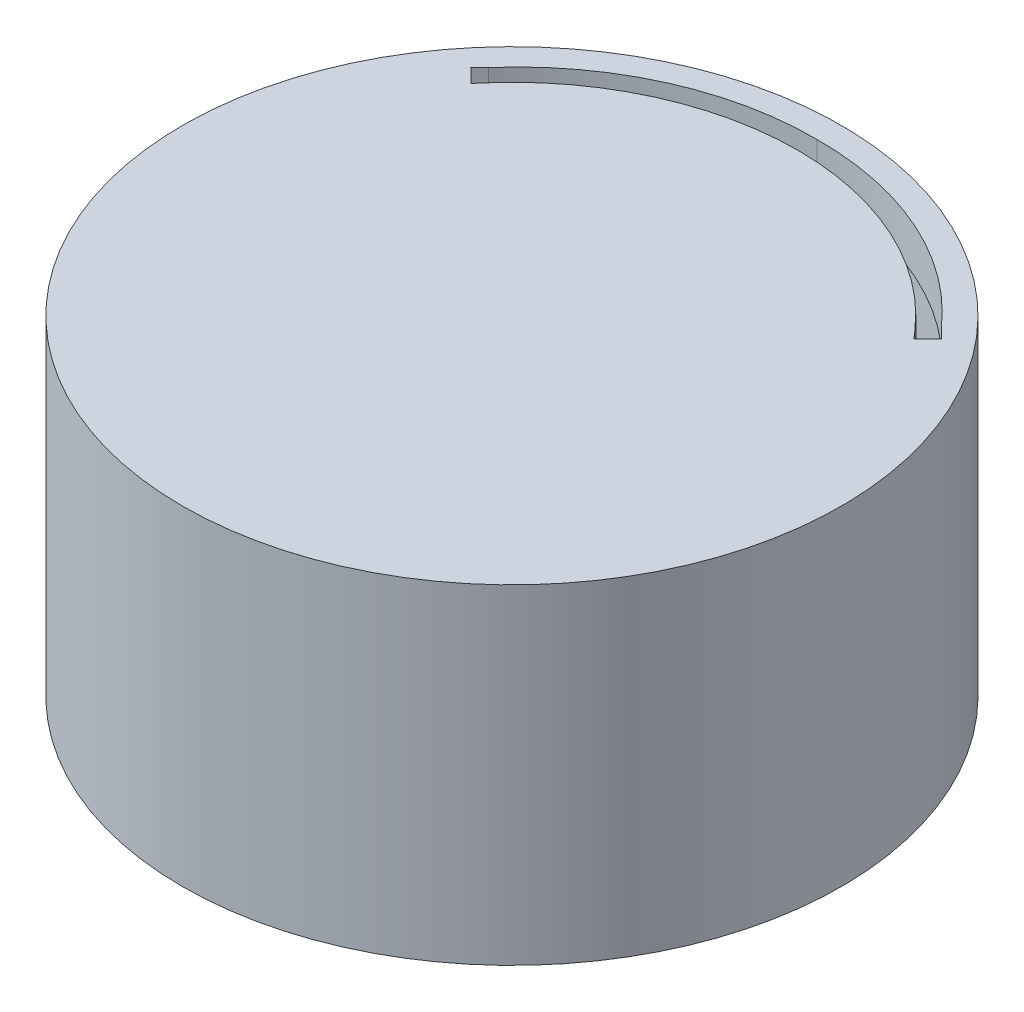
ISO-10303-21;
HEADER;
FILE_DESCRIPTION(('STEP AP214'),'2;1');
FILE_NAME('part.step','',(''),(''),'','','');
FILE_SCHEMA(('AUTOMOTIVE_DESIGN { 1 0 10303 214 1 1 1 1 }'));
ENDSEC;
DATA;
#1=APPLICATION_CONTEXT('core data for automotive mechanical design processes');
#2=APPLICATION_PROTOCOL_DEFINITION('international standard','automotive_design',2000,#1);
#3=PRODUCT_CONTEXT('',#1,'mechanical');
#4=PRODUCT('Part','Part','',(#3));
#5=PRODUCT_RELATED_PRODUCT_CATEGORY('part','',(#4));
#6=PRODUCT_DEFINITION_FORMATION('','',#4);
#7=PRODUCT_DEFINITION_CONTEXT('part definition',#1,'design');
#8=PRODUCT_DEFINITION('design','',#6,#7);
#9=PRODUCT_DEFINITION_SHAPE('','',#8);
#10=(LENGTH_UNIT() NAMED_UNIT(*) SI_UNIT(.MILLI.,.METRE.));
#11=(NAMED_UNIT(*) PLANE_ANGLE_UNIT() SI_UNIT($,.RADIAN.));
#12=(NAMED_UNIT(*) SI_UNIT($,.STERADIAN.) SOLID_ANGLE_UNIT());
#13=UNCERTAINTY_MEASURE_WITH_UNIT(LENGTH_MEASURE(1.E-05),#10,'distance_accuracy_value','');
#14=(GEOMETRIC_REPRESENTATION_CONTEXT(3) GLOBAL_UNCERTAINTY_ASSIGNED_CONTEXT((#13)) GLOBAL_UNIT_ASSIGNED_CONTEXT((#10,
#11,#12)) REPRESENTATION_CONTEXT('',''));
#15=CARTESIAN_POINT('',(0.,0.,0.));
#16=DIRECTION('',(0.,0.,1.));
#17=DIRECTION('',(1.,0.,0.));
#18=AXIS2_PLACEMENT_3D('',#15,#16,#17);
#19=CARTESIAN_POINT('',(0.,30.,0.));
#20=DIRECTION('',(0.,1.,0.));
#21=DIRECTION('',(0.,0.,1.));
#22=AXIS2_PLACEMENT_3D('',#19,#20,#21);
#23=PLANE('',#22);
#24=CARTESIAN_POINT('',(0.,30.,0.));
#25=DIRECTION('',(0.,1.,0.));
#26=DIRECTION('',(0.,0.,1.));
#27=AXIS2_PLACEMENT_3D('',#24,#25,#26);
#28=CIRCLE('',#27,30.);
#29=CARTESIAN_POINT('',(0.,30.,30.));
#30=VERTEX_POINT('',#29);
#31=EDGE_CURVE('E140',#30,#30,#28,.T.);
#32=ORIENTED_EDGE('',*,*,#31,.T.);
#33=EDGE_LOOP('',(#32));
#34=FACE_BOUND('',#33,.T.);
#35=CARTESIAN_POINT('',(-0.269476232128927,30.,-0.813193995065218));
#36=DIRECTION('',(0.,1.,0.));
#37=DIRECTION('',(0.,0.,1.));
#38=AXIS2_PLACEMENT_3D('',#35,#36,#37);
#39=CIRCLE('',#38,26.9706805768212);
#40=CARTESIAN_POINT('',(-0.0254023069730041,30.,-27.7827701633327));
#41=VERTEX_POINT('',#40);
#42=CARTESIAN_POINT('',(-20.6220749338951,30.,-18.5103501751351));
#43=VERTEX_POINT('',#42);
#44=EDGE_CURVE('E121',#41,#43,#39,.T.);
#45=ORIENTED_EDGE('',*,*,#44,.F.);
#46=CARTESIAN_POINT('',(0.218671618182906,30.,-0.813193995065218));
#47=DIRECTION('',(0.,1.,0.));
#48=DIRECTION('',(0.,0.,1.));
#49=AXIS2_PLACEMENT_3D('',#46,#47,#48);
#50=CIRCLE('',#49,26.9706805768212);
#51=CARTESIAN_POINT('',(20.5712703199491,30.,-18.5103501751351));
#52=VERTEX_POINT('',#51);
#53=EDGE_CURVE('E110',#41,#52,#50,.F.);
#54=ORIENTED_EDGE('',*,*,#53,.T.);
#55=DIRECTION('',(-0.707106781186542,0.,-0.707106781186554));
#56=VECTOR('',#55,1.);
#57=CARTESIAN_POINT('',(19.5408102475423,30.,-19.540810247542));
#58=LINE('',#57,#56);
#59=CARTESIAN_POINT('',(21.3902384528601,30.,-17.6913820422241));
#60=VERTEX_POINT('',#59);
#61=EDGE_CURVE('E115',#60,#52,#58,.T.);
#62=ORIENTED_EDGE('',*,*,#61,.F.);
#63=DIRECTION('',(-0.715524800333269,0.,0.698587331768932));
#64=VECTOR('',#63,1.);
#65=CARTESIAN_POINT('',(1.59580190612503,30.,1.63449262293414));
#66=LINE('',#65,#64);
#67=CARTESIAN_POINT('',(20.1244711318793,30.,-16.4555771966164));
#68=VERTEX_POINT('',#67);
#69=EDGE_CURVE('E185',#60,#68,#66,.T.);
#70=ORIENTED_EDGE('',*,*,#69,.T.);
#71=DIRECTION('',(-0.654896156385466,0.,-0.755718879181633));
#72=VECTOR('',#71,1.);
#73=CARTESIAN_POINT('',(19.6374586279711,30.,-17.0175663608715));
#74=LINE('',#73,#72);
#75=CARTESIAN_POINT('',(19.5005232357283,30.,-17.1755832619283));
#76=VERTEX_POINT('',#75);
#77=EDGE_CURVE('E188',#68,#76,#74,.T.);
#78=ORIENTED_EDGE('',*,*,#77,.T.);
#79=CARTESIAN_POINT('',(-0.0653695292751055,30.,-0.0864662667465453));
#80=DIRECTION('',(0.,1.,0.));
#81=DIRECTION('',(0.,0.,1.));
#82=AXIS2_PLACEMENT_3D('',#79,#80,#81);
#83=CIRCLE('',#82,25.978107694107);
#84=CARTESIAN_POINT('',(-0.0254023069730072,30.,-26.0645432161238));
#85=VERTEX_POINT('',#84);
#86=EDGE_CURVE('E191',#85,#76,#83,.F.);
#87=ORIENTED_EDGE('',*,*,#86,.F.);
#88=CARTESIAN_POINT('',(0.014564915329085,30.,-0.0864662667465453));
#89=DIRECTION('',(0.,1.,0.));
#90=DIRECTION('',(0.,0.,1.));
#91=AXIS2_PLACEMENT_3D('',#88,#89,#90);
#92=CIRCLE('',#91,25.978107694107);
#93=CARTESIAN_POINT('',(-19.5513278496743,30.,-17.1755832619283));
#94=VERTEX_POINT('',#93);
#95=EDGE_CURVE('E193',#85,#94,#92,.T.);
#96=ORIENTED_EDGE('',*,*,#95,.T.);
#97=DIRECTION('',(0.654896156385466,0.,-0.755718879181633));
#98=VECTOR('',#97,1.);
#99=CARTESIAN_POINT('',(-19.6664737030836,30.,-17.0427104477693));
#100=LINE('',#99,#98);
#101=CARTESIAN_POINT('',(-20.1752757458253,30.,-16.4555771966164));
#102=VERTEX_POINT('',#101);
#103=EDGE_CURVE('E196',#102,#94,#100,.T.);
#104=ORIENTED_EDGE('',*,*,#103,.F.);
#105=DIRECTION('',(0.715524800333269,0.,0.698587331768932));
#106=VECTOR('',#105,1.);
#107=CARTESIAN_POINT('',(-1.62059579025611,30.,1.65988764254816));
#108=LINE('',#107,#106);
#109=CARTESIAN_POINT('',(-21.4410430668062,30.,-17.6913820422241));
#110=VERTEX_POINT('',#109);
#111=EDGE_CURVE('E133',#110,#102,#108,.T.);
#112=ORIENTED_EDGE('',*,*,#111,.F.);
#113=DIRECTION('',(0.707106781186542,0.,-0.707106781186554));
#114=VECTOR('',#113,1.);
#115=CARTESIAN_POINT('',(-19.5662125545153,30.,-19.566212554515));
#116=LINE('',#115,#114);
#117=EDGE_CURVE('E127',#110,#43,#116,.T.);
#118=ORIENTED_EDGE('',*,*,#117,.T.);
#119=EDGE_LOOP('',(#45,#54,#62,#70,#78,#87,#96,#104,#112,#118));
#120=FACE_BOUND('',#119,.T.);
#121=ADVANCED_FACE('F36',(#34,#120),#23,.T.);
#122=CARTESIAN_POINT('',(0.,26.,0.));
#123=DIRECTION('',(0.,1.,0.));
#124=DIRECTION('',(0.,0.,1.));
#125=AXIS2_PLACEMENT_3D('',#122,#123,#124);
#126=PLANE('',#125);
#127=CARTESIAN_POINT('',(0.,26.,0.));
#128=DIRECTION('',(0.,1.,0.));
#129=DIRECTION('',(0.,0.,1.));
#130=AXIS2_PLACEMENT_3D('',#127,#128,#129);
#131=CIRCLE('',#130,29.);
#132=CARTESIAN_POINT('',(0.,26.,29.));
#133=VERTEX_POINT('',#132);
#134=EDGE_CURVE('E131',#133,#133,#131,.T.);
#135=ORIENTED_EDGE('',*,*,#134,.F.);
#136=EDGE_LOOP('',(#135));
#137=FACE_BOUND('',#136,.T.);
#138=CARTESIAN_POINT('',(0.218671618182906,26.,-0.813193995065218));
#139=DIRECTION('',(0.,1.,0.));
#140=DIRECTION('',(0.,0.,1.));
#141=AXIS2_PLACEMENT_3D('',#138,#139,#140);
#142=CIRCLE('',#141,26.9706805768212);
#143=CARTESIAN_POINT('',(-0.0254023069730041,26.,-27.7827701633327));
#144=VERTEX_POINT('',#143);
#145=CARTESIAN_POINT('',(20.5712703199491,26.,-18.5103501751351));
#146=VERTEX_POINT('',#145);
#147=EDGE_CURVE('E143',#144,#146,#142,.F.);
#148=ORIENTED_EDGE('',*,*,#147,.F.);
#149=CARTESIAN_POINT('',(-0.269476232128927,26.,-0.813193995065218));
#150=DIRECTION('',(0.,1.,0.));
#151=DIRECTION('',(0.,0.,1.));
#152=AXIS2_PLACEMENT_3D('',#149,#150,#151);
#153=CIRCLE('',#152,26.9706805768212);
#154=CARTESIAN_POINT('',(-20.6220749338951,26.,-18.5103501751351));
#155=VERTEX_POINT('',#154);
#156=EDGE_CURVE('E11',#144,#155,#153,.T.);
#157=ORIENTED_EDGE('',*,*,#156,.T.);
#158=DIRECTION('',(0.707106781186542,0.,-0.707106781186554));
#159=VECTOR('',#158,1.);
#160=CARTESIAN_POINT('',(-19.5662125545153,26.,-19.566212554515));
#161=LINE('',#160,#159);
#162=CARTESIAN_POINT('',(-21.4410430668062,26.,-17.6913820422241));
#163=VERTEX_POINT('',#162);
#164=EDGE_CURVE('E44',#163,#155,#161,.T.);
#165=ORIENTED_EDGE('',*,*,#164,.F.);
#166=DIRECTION('',(0.715524800333269,0.,0.698587331768932));
#167=VECTOR('',#166,1.);
#168=CARTESIAN_POINT('',(-1.62059579025611,26.,1.65988764254816));
#169=LINE('',#168,#167);
#170=CARTESIAN_POINT('',(-20.1752757458253,26.,-16.4555771966164));
#171=VERTEX_POINT('',#170);
#172=EDGE_CURVE('E162',#163,#171,#169,.T.);
#173=ORIENTED_EDGE('',*,*,#172,.T.);
#174=DIRECTION('',(0.654896156385466,0.,-0.755718879181633));
#175=VECTOR('',#174,1.);
#176=CARTESIAN_POINT('',(-19.6664737030836,26.,-17.0427104477693));
#177=LINE('',#176,#175);
#178=CARTESIAN_POINT('',(-19.5513278496743,26.,-17.1755832619283));
#179=VERTEX_POINT('',#178);
#180=EDGE_CURVE('E159',#171,#179,#177,.T.);
#181=ORIENTED_EDGE('',*,*,#180,.T.);
#182=CARTESIAN_POINT('',(0.014564915329085,26.,-0.0864662667465453));
#183=DIRECTION('',(0.,1.,0.));
#184=DIRECTION('',(0.,0.,1.));
#185=AXIS2_PLACEMENT_3D('',#182,#183,#184);
#186=CIRCLE('',#185,25.978107694107);
#187=CARTESIAN_POINT('',(-0.0254023069730072,26.,-26.0645432161238));
#188=VERTEX_POINT('',#187);
#189=EDGE_CURVE('E157',#188,#179,#186,.T.);
#190=ORIENTED_EDGE('',*,*,#189,.F.);
#191=CARTESIAN_POINT('',(-0.0653695292751055,26.,-0.0864662667465453));
#192=DIRECTION('',(0.,1.,0.));
#193=DIRECTION('',(0.,0.,1.));
#194=AXIS2_PLACEMENT_3D('',#191,#192,#193);
#195=CIRCLE('',#194,25.978107694107);
#196=CARTESIAN_POINT('',(19.5005232357283,26.,-17.1755832619283));
#197=VERTEX_POINT('',#196);
#198=EDGE_CURVE('E154',#188,#197,#195,.F.);
#199=ORIENTED_EDGE('',*,*,#198,.T.);
#200=DIRECTION('',(-0.654896156385466,0.,-0.755718879181633));
#201=VECTOR('',#200,1.);
#202=CARTESIAN_POINT('',(19.6374586279711,26.,-17.0175663608715));
#203=LINE('',#202,#201);
#204=CARTESIAN_POINT('',(20.1244711318793,26.,-16.4555771966164));
#205=VERTEX_POINT('',#204);
#206=EDGE_CURVE('E152',#205,#197,#203,.T.);
#207=ORIENTED_EDGE('',*,*,#206,.F.);
#208=DIRECTION('',(-0.715524800333269,0.,0.698587331768932));
#209=VECTOR('',#208,1.);
#210=CARTESIAN_POINT('',(1.59580190612503,26.,1.63449262293414));
#211=LINE('',#210,#209);
#212=CARTESIAN_POINT('',(21.3902384528601,26.,-17.6913820422241));
#213=VERTEX_POINT('',#212);
#214=EDGE_CURVE('E150',#213,#205,#211,.T.);
#215=ORIENTED_EDGE('',*,*,#214,.F.);
#216=DIRECTION('',(-0.707106781186542,0.,-0.707106781186554));
#217=VECTOR('',#216,1.);
#218=CARTESIAN_POINT('',(19.5408102475423,26.,-19.540810247542));
#219=LINE('',#218,#217);
#220=EDGE_CURVE('E147',#213,#146,#219,.T.);
#221=ORIENTED_EDGE('',*,*,#220,.T.);
#222=EDGE_LOOP('',(#148,#157,#165,#173,#181,#190,#199,#207,#215,#221));
#223=FACE_BOUND('',#222,.T.);
#224=ADVANCED_FACE('F172',(#137,#223),#126,.F.);
#225=CARTESIAN_POINT('',(0.,30.,0.));
#226=DIRECTION('',(0.,-1.,0.));
#227=DIRECTION('',(0.,0.,-1.));
#228=AXIS2_PLACEMENT_3D('',#225,#226,#227);
#229=CYLINDRICAL_SURFACE('',#228,30.);
#230=ORIENTED_EDGE('',*,*,#31,.F.);
#231=EDGE_LOOP('',(#230));
#232=FACE_BOUND('',#231,.T.);
#233=CARTESIAN_POINT('',(0.,0.,0.));
#234=DIRECTION('',(0.,1.,0.));
#235=DIRECTION('',(0.,0.,1.));
#236=AXIS2_PLACEMENT_3D('',#233,#234,#235);
#237=CIRCLE('',#236,30.);
#238=CARTESIAN_POINT('',(0.,0.,30.));
#239=VERTEX_POINT('',#238);
#240=EDGE_CURVE('E138',#239,#239,#237,.T.);
#241=ORIENTED_EDGE('',*,*,#240,.T.);
#242=EDGE_LOOP('',(#241));
#243=FACE_BOUND('',#242,.T.);
#244=ADVANCED_FACE('F38',(#232,#243),#229,.T.);
#245=CARTESIAN_POINT('',(0.,0.,0.));
#246=DIRECTION('',(0.,1.,0.));
#247=DIRECTION('',(0.,0.,1.));
#248=AXIS2_PLACEMENT_3D('',#245,#246,#247);
#249=PLANE('',#248);
#250=CARTESIAN_POINT('',(0.,0.,0.));
#251=DIRECTION('',(0.,1.,0.));
#252=DIRECTION('',(0.,0.,1.));
#253=AXIS2_PLACEMENT_3D('',#250,#251,#252);
#254=CIRCLE('',#253,29.);
#255=CARTESIAN_POINT('',(0.,0.,29.));
#256=VERTEX_POINT('',#255);
#257=EDGE_CURVE('E128',#256,#256,#254,.T.);
#258=ORIENTED_EDGE('',*,*,#257,.T.);
#259=EDGE_LOOP('',(#258));
#260=FACE_BOUND('',#259,.T.);
#261=ORIENTED_EDGE('',*,*,#240,.F.);
#262=EDGE_LOOP('',(#261));
#263=FACE_BOUND('',#262,.T.);
#264=ADVANCED_FACE('F249',(#260,#263),#249,.F.);
#265=CARTESIAN_POINT('',(0.,26.,0.));
#266=DIRECTION('',(0.,-1.,0.));
#267=DIRECTION('',(0.,0.,-1.));
#268=AXIS2_PLACEMENT_3D('',#265,#266,#267);
#269=CYLINDRICAL_SURFACE('',#268,29.);
#270=ORIENTED_EDGE('',*,*,#134,.T.);
#271=EDGE_LOOP('',(#270));
#272=FACE_BOUND('',#271,.T.);
#273=ORIENTED_EDGE('',*,*,#257,.F.);
#274=EDGE_LOOP('',(#273));
#275=FACE_BOUND('',#274,.T.);
#276=ADVANCED_FACE('F248',(#272,#275),#269,.F.);
#277=CARTESIAN_POINT('',(-0.269476232128927,74.,-0.813193995065218));
#278=DIRECTION('',(0.,-1.,0.));
#279=DIRECTION('',(0.,0.,-1.));
#280=AXIS2_PLACEMENT_3D('',#277,#278,#279);
#281=CYLINDRICAL_SURFACE('',#280,26.9706805768212);
#282=ORIENTED_EDGE('',*,*,#44,.T.);
#283=DIRECTION('',(0.,-1.,0.));
#284=VECTOR('',#283,1.);
#285=CARTESIAN_POINT('',(-20.6220749338951,74.,-18.5103501751351));
#286=LINE('',#285,#284);
#287=EDGE_CURVE('E116',#43,#155,#286,.T.);
#288=ORIENTED_EDGE('',*,*,#287,.T.);
#289=ORIENTED_EDGE('',*,*,#156,.F.);
#290=DIRECTION('',(0.,-1.,0.));
#291=VECTOR('',#290,1.);
#292=CARTESIAN_POINT('',(-0.0254023069730041,74.,-27.7827701633327));
#293=LINE('',#292,#291);
#294=EDGE_CURVE('E56',#41,#144,#293,.T.);
#295=ORIENTED_EDGE('',*,*,#294,.F.);
#296=EDGE_LOOP('',(#282,#288,#289,#295));
#297=FACE_BOUND('',#296,.T.);
#298=ADVANCED_FACE('F119',(#297),#281,.F.);
#299=CARTESIAN_POINT('',(-20.6220749338951,74.,-18.5103501751351));
#300=DIRECTION('',(0.707106781186554,0.,0.707106781186542));
#301=DIRECTION('',(0.707106781186542,0.,-0.707106781186554));
#302=AXIS2_PLACEMENT_3D('',#299,#300,#301);
#303=PLANE('',#302);
#304=DIRECTION('',(0.,-1.,0.));
#305=VECTOR('',#304,1.);
#306=CARTESIAN_POINT('',(-21.4410430668062,74.,-17.6913820422241));
#307=LINE('',#306,#305);
#308=EDGE_CURVE('E169',#110,#163,#307,.T.);
#309=ORIENTED_EDGE('',*,*,#308,.T.);
#310=ORIENTED_EDGE('',*,*,#164,.T.);
#311=ORIENTED_EDGE('',*,*,#287,.F.);
#312=ORIENTED_EDGE('',*,*,#117,.F.);
#313=EDGE_LOOP('',(#309,#310,#311,#312));
#314=FACE_BOUND('',#313,.T.);
#315=ADVANCED_FACE('F167',(#314),#303,.T.);
#316=CARTESIAN_POINT('',(-20.1752757458253,74.,-16.4555771966164));
#317=DIRECTION('',(-0.698587331768932,0.,0.715524800333269));
#318=DIRECTION('',(0.715524800333269,0.,0.698587331768932));
#319=AXIS2_PLACEMENT_3D('',#316,#317,#318);
#320=PLANE('',#319);
#321=ORIENTED_EDGE('',*,*,#111,.T.);
#322=DIRECTION('',(0.,-1.,0.));
#323=VECTOR('',#322,1.);
#324=CARTESIAN_POINT('',(-20.1752757458253,74.,-16.4555771966164));
#325=LINE('',#324,#323);
#326=EDGE_CURVE('E201',#102,#171,#325,.T.);
#327=ORIENTED_EDGE('',*,*,#326,.T.);
#328=ORIENTED_EDGE('',*,*,#172,.F.);
#329=ORIENTED_EDGE('',*,*,#308,.F.);
#330=EDGE_LOOP('',(#321,#327,#328,#329));
#331=FACE_BOUND('',#330,.T.);
#332=ADVANCED_FACE('F200',(#331),#320,.F.);
#333=CARTESIAN_POINT('',(-19.5513278496743,74.,-17.1755832619283));
#334=DIRECTION('',(0.755718879181633,0.,0.654896156385466));
#335=DIRECTION('',(0.654896156385466,0.,-0.755718879181633));
#336=AXIS2_PLACEMENT_3D('',#333,#334,#335);
#337=PLANE('',#336);
#338=ORIENTED_EDGE('',*,*,#103,.T.);
#339=DIRECTION('',(0.,-1.,0.));
#340=VECTOR('',#339,1.);
#341=CARTESIAN_POINT('',(-19.5513278496743,74.,-17.1755832619283));
#342=LINE('',#341,#340);
#343=EDGE_CURVE('E207',#94,#179,#342,.T.);
#344=ORIENTED_EDGE('',*,*,#343,.T.);
#345=ORIENTED_EDGE('',*,*,#180,.F.);
#346=ORIENTED_EDGE('',*,*,#326,.F.);
#347=EDGE_LOOP('',(#338,#344,#345,#346));
#348=FACE_BOUND('',#347,.T.);
#349=ADVANCED_FACE('F204',(#348),#337,.F.);
#350=CARTESIAN_POINT('',(0.014564915329085,74.,-0.0864662667465453));
#351=DIRECTION('',(0.,-1.,0.));
#352=DIRECTION('',(0.,0.,-1.));
#353=AXIS2_PLACEMENT_3D('',#350,#351,#352);
#354=CYLINDRICAL_SURFACE('',#353,25.978107694107);
#355=DIRECTION('',(0.,-1.,0.));
#356=VECTOR('',#355,1.);
#357=CARTESIAN_POINT('',(-0.0254023069730072,74.,-26.0645432161238));
#358=LINE('',#357,#356);
#359=EDGE_CURVE('E214',#85,#188,#358,.T.);
#360=ORIENTED_EDGE('',*,*,#359,.T.);
#361=ORIENTED_EDGE('',*,*,#189,.T.);
#362=ORIENTED_EDGE('',*,*,#343,.F.);
#363=ORIENTED_EDGE('',*,*,#95,.F.);
#364=EDGE_LOOP('',(#360,#361,#362,#363));
#365=FACE_BOUND('',#364,.T.);
#366=ADVANCED_FACE('F213',(#365),#354,.T.);
#367=CARTESIAN_POINT('',(-0.0653695292751055,74.,-0.0864662667465453));
#368=DIRECTION('',(0.,-1.,0.));
#369=DIRECTION('',(0.,0.,-1.));
#370=AXIS2_PLACEMENT_3D('',#367,#368,#369);
#371=CYLINDRICAL_SURFACE('',#370,25.978107694107);
#372=ORIENTED_EDGE('',*,*,#86,.T.);
#373=DIRECTION('',(0.,-1.,0.));
#374=VECTOR('',#373,1.);
#375=CARTESIAN_POINT('',(19.5005232357283,74.,-17.1755832619283));
#376=LINE('',#375,#374);
#377=EDGE_CURVE('E220',#76,#197,#376,.T.);
#378=ORIENTED_EDGE('',*,*,#377,.T.);
#379=ORIENTED_EDGE('',*,*,#198,.F.);
#380=ORIENTED_EDGE('',*,*,#359,.F.);
#381=EDGE_LOOP('',(#372,#378,#379,#380));
#382=FACE_BOUND('',#381,.T.);
#383=ADVANCED_FACE('F217',(#382),#371,.T.);
#384=CARTESIAN_POINT('',(19.5005232357283,74.,-17.1755832619283));
#385=DIRECTION('',(0.755718879181633,0.,-0.654896156385466));
#386=DIRECTION('',(-0.654896156385466,0.,-0.755718879181633));
#387=AXIS2_PLACEMENT_3D('',#384,#385,#386);
#388=PLANE('',#387);
#389=DIRECTION('',(0.,-1.,0.));
#390=VECTOR('',#389,1.);
#391=CARTESIAN_POINT('',(20.1244711318793,74.,-16.4555771966164));
#392=LINE('',#391,#390);
#393=EDGE_CURVE('E180',#68,#205,#392,.T.);
#394=ORIENTED_EDGE('',*,*,#393,.T.);
#395=ORIENTED_EDGE('',*,*,#206,.T.);
#396=ORIENTED_EDGE('',*,*,#377,.F.);
#397=ORIENTED_EDGE('',*,*,#77,.F.);
#398=EDGE_LOOP('',(#394,#395,#396,#397));
#399=FACE_BOUND('',#398,.T.);
#400=ADVANCED_FACE('F228',(#399),#388,.T.);
#401=CARTESIAN_POINT('',(20.1244711318793,74.,-16.4555771966164));
#402=DIRECTION('',(-0.698587331768932,0.,-0.715524800333269));
#403=DIRECTION('',(-0.715524800333269,0.,0.698587331768932));
#404=AXIS2_PLACEMENT_3D('',#401,#402,#403);
#405=PLANE('',#404);
#406=DIRECTION('',(0.,-1.,0.));
#407=VECTOR('',#406,1.);
#408=CARTESIAN_POINT('',(21.3902384528601,74.,-17.6913820422241));
#409=LINE('',#408,#407);
#410=EDGE_CURVE('E178',#60,#213,#409,.T.);
#411=ORIENTED_EDGE('',*,*,#410,.T.);
#412=ORIENTED_EDGE('',*,*,#214,.T.);
#413=ORIENTED_EDGE('',*,*,#393,.F.);
#414=ORIENTED_EDGE('',*,*,#69,.F.);
#415=EDGE_LOOP('',(#411,#412,#413,#414));
#416=FACE_BOUND('',#415,.T.);
#417=ADVANCED_FACE('F230',(#416),#405,.T.);
#418=CARTESIAN_POINT('',(20.5712703199491,74.,-18.5103501751351));
#419=DIRECTION('',(0.707106781186554,0.,-0.707106781186542));
#420=DIRECTION('',(-0.707106781186542,0.,-0.707106781186554));
#421=AXIS2_PLACEMENT_3D('',#418,#419,#420);
#422=PLANE('',#421);
#423=ORIENTED_EDGE('',*,*,#61,.T.);
#424=DIRECTION('',(0.,-1.,0.));
#425=VECTOR('',#424,1.);
#426=CARTESIAN_POINT('',(20.5712703199491,74.,-18.5103501751351));
#427=LINE('',#426,#425);
#428=EDGE_CURVE('E51',#52,#146,#427,.T.);
#429=ORIENTED_EDGE('',*,*,#428,.T.);
#430=ORIENTED_EDGE('',*,*,#220,.F.);
#431=ORIENTED_EDGE('',*,*,#410,.F.);
#432=EDGE_LOOP('',(#423,#429,#430,#431));
#433=FACE_BOUND('',#432,.T.);
#434=ADVANCED_FACE('F175',(#433),#422,.F.);
#435=CARTESIAN_POINT('',(0.218671618182906,74.,-0.813193995065218));
#436=DIRECTION('',(0.,-1.,0.));
#437=DIRECTION('',(0.,0.,-1.));
#438=AXIS2_PLACEMENT_3D('',#435,#436,#437);
#439=CYLINDRICAL_SURFACE('',#438,26.9706805768212);
#440=ORIENTED_EDGE('',*,*,#294,.T.);
#441=ORIENTED_EDGE('',*,*,#147,.T.);
#442=ORIENTED_EDGE('',*,*,#428,.F.);
#443=ORIENTED_EDGE('',*,*,#53,.F.);
#444=EDGE_LOOP('',(#440,#441,#442,#443));
#445=FACE_BOUND('',#444,.T.);
#446=ADVANCED_FACE('F111',(#445),#439,.F.);
#447=CLOSED_SHELL('',(#121,#224,#244,#264,#276,#298,#315,#332,#349,#366,#383,#400,#417,#434,#446));
#448=MANIFOLD_SOLID_BREP('B2',#447);
#449=ADVANCED_BREP_SHAPE_REPRESENTATION('',(#18,#448),#14);
#450=SHAPE_DEFINITION_REPRESENTATION(#9,#449);
ENDSEC;
END-ISO-10303-21;
